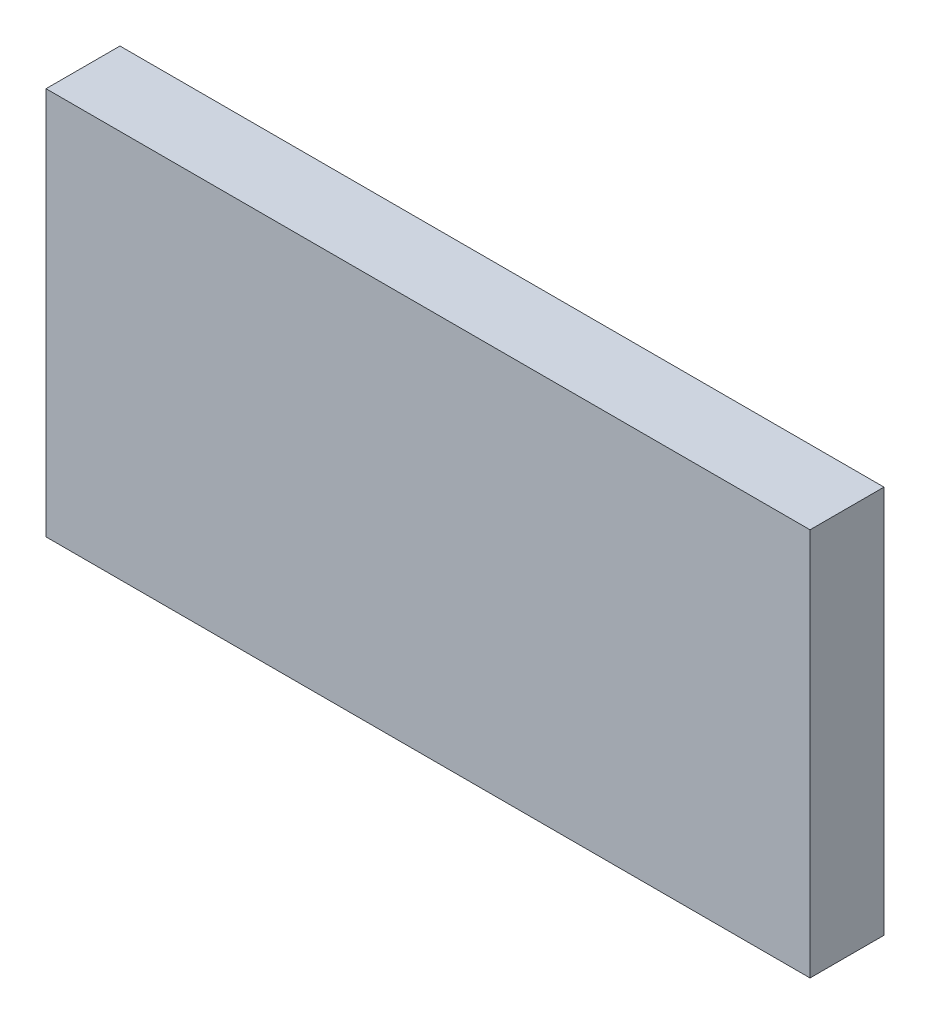
ISO-10303-21;
HEADER;
FILE_DESCRIPTION(('STEP AP214'),'2;1');
FILE_NAME('part.step','',(''),(''),'','','');
FILE_SCHEMA(('AUTOMOTIVE_DESIGN { 1 0 10303 214 1 1 1 1 }'));
ENDSEC;
DATA;
#1=APPLICATION_CONTEXT('core data for automotive mechanical design processes');
#2=APPLICATION_PROTOCOL_DEFINITION('international standard','automotive_design',2000,#1);
#3=PRODUCT_CONTEXT('',#1,'mechanical');
#4=PRODUCT('Part','Part','',(#3));
#5=PRODUCT_RELATED_PRODUCT_CATEGORY('part','',(#4));
#6=PRODUCT_DEFINITION_FORMATION('','',#4);
#7=PRODUCT_DEFINITION_CONTEXT('part definition',#1,'design');
#8=PRODUCT_DEFINITION('design','',#6,#7);
#9=PRODUCT_DEFINITION_SHAPE('','',#8);
#10=(LENGTH_UNIT() NAMED_UNIT(*) SI_UNIT(.MILLI.,.METRE.));
#11=(NAMED_UNIT(*) PLANE_ANGLE_UNIT() SI_UNIT($,.RADIAN.));
#12=(NAMED_UNIT(*) SI_UNIT($,.STERADIAN.) SOLID_ANGLE_UNIT());
#13=UNCERTAINTY_MEASURE_WITH_UNIT(LENGTH_MEASURE(1.E-05),#10,'distance_accuracy_value','');
#14=(GEOMETRIC_REPRESENTATION_CONTEXT(3) GLOBAL_UNCERTAINTY_ASSIGNED_CONTEXT((#13)) GLOBAL_UNIT_ASSIGNED_CONTEXT((#10,
#11,#12)) REPRESENTATION_CONTEXT('',''));
#15=CARTESIAN_POINT('',(0.,0.,0.));
#16=DIRECTION('',(0.,0.,1.));
#17=DIRECTION('',(1.,0.,0.));
#18=AXIS2_PLACEMENT_3D('',#15,#16,#17);
#19=CARTESIAN_POINT('',(3.1,-1.575,0.));
#20=DIRECTION('',(1.,0.,0.));
#21=DIRECTION('',(0.,1.,0.));
#22=AXIS2_PLACEMENT_3D('',#19,#20,#21);
#23=PLANE('',#22);
#24=DIRECTION('',(0.,-1.,0.));
#25=VECTOR('',#24,1.);
#26=CARTESIAN_POINT('',(3.1,1.575,0.));
#27=LINE('',#26,#25);
#28=CARTESIAN_POINT('',(3.1,1.575,0.));
#29=VERTEX_POINT('',#28);
#30=CARTESIAN_POINT('',(3.1,-1.575,0.));
#31=VERTEX_POINT('',#30);
#32=EDGE_CURVE('E11',#29,#31,#27,.T.);
#33=ORIENTED_EDGE('',*,*,#32,.F.);
#34=DIRECTION('',(0.,0.,1.));
#35=VECTOR('',#34,1.);
#36=CARTESIAN_POINT('',(3.1,1.575,0.));
#37=LINE('',#36,#35);
#38=CARTESIAN_POINT('',(3.1,1.575,0.6));
#39=VERTEX_POINT('',#38);
#40=EDGE_CURVE('E88',#29,#39,#37,.T.);
#41=ORIENTED_EDGE('',*,*,#40,.T.);
#42=DIRECTION('',(0.,1.,0.));
#43=VECTOR('',#42,1.);
#44=CARTESIAN_POINT('',(3.1,-1.575,0.6));
#45=LINE('',#44,#43);
#46=CARTESIAN_POINT('',(3.1,-1.575,0.6));
#47=VERTEX_POINT('',#46);
#48=EDGE_CURVE('E77',#47,#39,#45,.T.);
#49=ORIENTED_EDGE('',*,*,#48,.F.);
#50=DIRECTION('',(0.,0.,1.));
#51=VECTOR('',#50,1.);
#52=CARTESIAN_POINT('',(3.1,-1.575,0.));
#53=LINE('',#52,#51);
#54=EDGE_CURVE('E84',#31,#47,#53,.T.);
#55=ORIENTED_EDGE('',*,*,#54,.F.);
#56=EDGE_LOOP('',(#33,#41,#49,#55));
#57=FACE_BOUND('',#56,.T.);
#58=ADVANCED_FACE('F17',(#57),#23,.T.);
#59=CARTESIAN_POINT('',(-3.1,-1.575,0.));
#60=DIRECTION('',(0.,-1.,0.));
#61=DIRECTION('',(1.,0.,0.));
#62=AXIS2_PLACEMENT_3D('',#59,#60,#61);
#63=PLANE('',#62);
#64=DIRECTION('',(-1.,0.,0.));
#65=VECTOR('',#64,1.);
#66=CARTESIAN_POINT('',(3.1,-1.575,0.));
#67=LINE('',#66,#65);
#68=CARTESIAN_POINT('',(-3.1,-1.575,0.));
#69=VERTEX_POINT('',#68);
#70=EDGE_CURVE('E24',#31,#69,#67,.T.);
#71=ORIENTED_EDGE('',*,*,#70,.F.);
#72=ORIENTED_EDGE('',*,*,#54,.T.);
#73=DIRECTION('',(1.,0.,0.));
#74=VECTOR('',#73,1.);
#75=CARTESIAN_POINT('',(-3.1,-1.575,0.6));
#76=LINE('',#75,#74);
#77=CARTESIAN_POINT('',(-3.1,-1.575,0.6));
#78=VERTEX_POINT('',#77);
#79=EDGE_CURVE('E65',#78,#47,#76,.T.);
#80=ORIENTED_EDGE('',*,*,#79,.F.);
#81=DIRECTION('',(0.,0.,1.));
#82=VECTOR('',#81,1.);
#83=CARTESIAN_POINT('',(-3.1,-1.575,0.));
#84=LINE('',#83,#82);
#85=EDGE_CURVE('E70',#69,#78,#84,.T.);
#86=ORIENTED_EDGE('',*,*,#85,.F.);
#87=EDGE_LOOP('',(#71,#72,#80,#86));
#88=FACE_BOUND('',#87,.T.);
#89=ADVANCED_FACE('F91',(#88),#63,.T.);
#90=CARTESIAN_POINT('',(-3.1,1.575,0.));
#91=DIRECTION('',(-1.,0.,0.));
#92=DIRECTION('',(0.,-1.,0.));
#93=AXIS2_PLACEMENT_3D('',#90,#91,#92);
#94=PLANE('',#93);
#95=DIRECTION('',(0.,1.,0.));
#96=VECTOR('',#95,1.);
#97=CARTESIAN_POINT('',(-3.1,-1.575,0.));
#98=LINE('',#97,#96);
#99=CARTESIAN_POINT('',(-3.1,1.575,0.));
#100=VERTEX_POINT('',#99);
#101=EDGE_CURVE('E86',#69,#100,#98,.T.);
#102=ORIENTED_EDGE('',*,*,#101,.F.);
#103=ORIENTED_EDGE('',*,*,#85,.T.);
#104=DIRECTION('',(0.,-1.,0.));
#105=VECTOR('',#104,1.);
#106=CARTESIAN_POINT('',(-3.1,1.575,0.6));
#107=LINE('',#106,#105);
#108=CARTESIAN_POINT('',(-3.1,1.575,0.6));
#109=VERTEX_POINT('',#108);
#110=EDGE_CURVE('E66',#109,#78,#107,.T.);
#111=ORIENTED_EDGE('',*,*,#110,.F.);
#112=DIRECTION('',(0.,0.,1.));
#113=VECTOR('',#112,1.);
#114=CARTESIAN_POINT('',(-3.1,1.575,0.));
#115=LINE('',#114,#113);
#116=EDGE_CURVE('E55',#100,#109,#115,.T.);
#117=ORIENTED_EDGE('',*,*,#116,.F.);
#118=EDGE_LOOP('',(#102,#103,#111,#117));
#119=FACE_BOUND('',#118,.T.);
#120=ADVANCED_FACE('F69',(#119),#94,.T.);
#121=CARTESIAN_POINT('',(3.1,1.575,0.));
#122=DIRECTION('',(0.,1.,0.));
#123=DIRECTION('',(-1.,0.,0.));
#124=AXIS2_PLACEMENT_3D('',#121,#122,#123);
#125=PLANE('',#124);
#126=DIRECTION('',(1.,0.,0.));
#127=VECTOR('',#126,1.);
#128=CARTESIAN_POINT('',(-3.1,1.575,0.));
#129=LINE('',#128,#127);
#130=EDGE_CURVE('E62',#100,#29,#129,.T.);
#131=ORIENTED_EDGE('',*,*,#130,.F.);
#132=ORIENTED_EDGE('',*,*,#116,.T.);
#133=DIRECTION('',(-1.,0.,0.));
#134=VECTOR('',#133,1.);
#135=CARTESIAN_POINT('',(3.1,1.575,0.6));
#136=LINE('',#135,#134);
#137=EDGE_CURVE('E60',#39,#109,#136,.T.);
#138=ORIENTED_EDGE('',*,*,#137,.F.);
#139=ORIENTED_EDGE('',*,*,#40,.F.);
#140=EDGE_LOOP('',(#131,#132,#138,#139));
#141=FACE_BOUND('',#140,.T.);
#142=ADVANCED_FACE('F57',(#141),#125,.T.);
#143=CARTESIAN_POINT('',(0.,0.,0.));
#144=DIRECTION('',(0.,0.,1.));
#145=DIRECTION('',(1.,0.,0.));
#146=AXIS2_PLACEMENT_3D('',#143,#144,#145);
#147=PLANE('',#146);
#148=ORIENTED_EDGE('',*,*,#130,.T.);
#149=ORIENTED_EDGE('',*,*,#32,.T.);
#150=ORIENTED_EDGE('',*,*,#70,.T.);
#151=ORIENTED_EDGE('',*,*,#101,.T.);
#152=EDGE_LOOP('',(#148,#149,#150,#151));
#153=FACE_BOUND('',#152,.T.);
#154=ADVANCED_FACE('F90',(#153),#147,.F.);
#155=CARTESIAN_POINT('',(0.,0.,0.6));
#156=DIRECTION('',(0.,0.,1.));
#157=DIRECTION('',(1.,0.,0.));
#158=AXIS2_PLACEMENT_3D('',#155,#156,#157);
#159=PLANE('',#158);
#160=ORIENTED_EDGE('',*,*,#137,.T.);
#161=ORIENTED_EDGE('',*,*,#110,.T.);
#162=ORIENTED_EDGE('',*,*,#79,.T.);
#163=ORIENTED_EDGE('',*,*,#48,.T.);
#164=EDGE_LOOP('',(#160,#161,#162,#163));
#165=FACE_BOUND('',#164,.T.);
#166=ADVANCED_FACE('F75',(#165),#159,.T.);
#167=CLOSED_SHELL('',(#58,#89,#120,#142,#154,#166));
#168=MANIFOLD_SOLID_BREP('B1',#167);
#169=ADVANCED_BREP_SHAPE_REPRESENTATION('',(#18,#168),#14);
#170=SHAPE_DEFINITION_REPRESENTATION(#9,#169);
ENDSEC;
END-ISO-10303-21;
